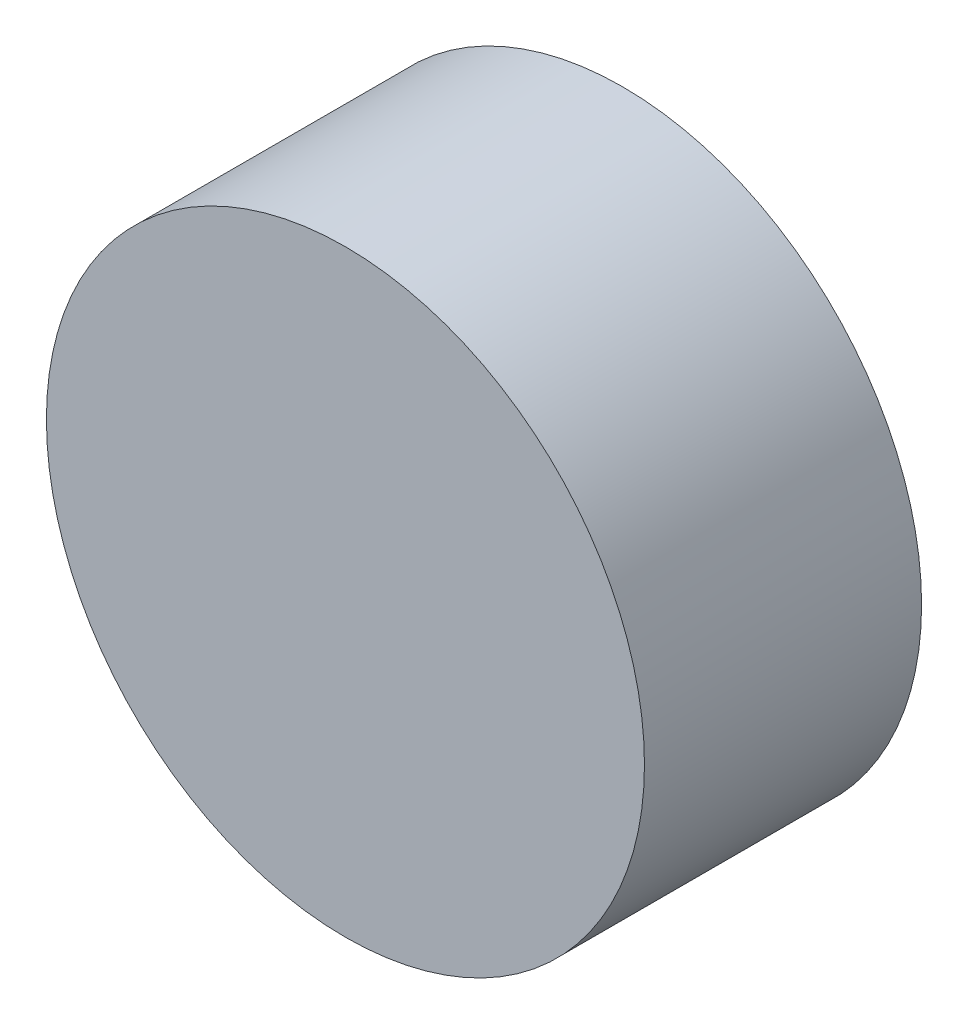
ISO-10303-21;
HEADER;
FILE_DESCRIPTION(('STEP AP214'),'2;1');
FILE_NAME('part.step','',(''),(''),'','','');
FILE_SCHEMA(('AUTOMOTIVE_DESIGN { 1 0 10303 214 1 1 1 1 }'));
ENDSEC;
DATA;
#1=APPLICATION_CONTEXT('core data for automotive mechanical design processes');
#2=APPLICATION_PROTOCOL_DEFINITION('international standard','automotive_design',2000,#1);
#3=PRODUCT_CONTEXT('',#1,'mechanical');
#4=PRODUCT('Part','Part','',(#3));
#5=PRODUCT_RELATED_PRODUCT_CATEGORY('part','',(#4));
#6=PRODUCT_DEFINITION_FORMATION('','',#4);
#7=PRODUCT_DEFINITION_CONTEXT('part definition',#1,'design');
#8=PRODUCT_DEFINITION('design','',#6,#7);
#9=PRODUCT_DEFINITION_SHAPE('','',#8);
#10=(LENGTH_UNIT() NAMED_UNIT(*) SI_UNIT(.MILLI.,.METRE.));
#11=(NAMED_UNIT(*) PLANE_ANGLE_UNIT() SI_UNIT($,.RADIAN.));
#12=(NAMED_UNIT(*) SI_UNIT($,.STERADIAN.) SOLID_ANGLE_UNIT());
#13=UNCERTAINTY_MEASURE_WITH_UNIT(LENGTH_MEASURE(1.E-05),#10,'distance_accuracy_value','');
#14=(GEOMETRIC_REPRESENTATION_CONTEXT(3) GLOBAL_UNCERTAINTY_ASSIGNED_CONTEXT((#13)) GLOBAL_UNIT_ASSIGNED_CONTEXT((#10,
#11,#12)) REPRESENTATION_CONTEXT('',''));
#15=CARTESIAN_POINT('',(0.,0.,0.));
#16=DIRECTION('',(0.,0.,1.));
#17=DIRECTION('',(1.,0.,0.));
#18=AXIS2_PLACEMENT_3D('',#15,#16,#17);
#19=CARTESIAN_POINT('',(28.,15.9999999999979,5.588));
#20=DIRECTION('',(0.,0.,-1.));
#21=DIRECTION('',(-1.,0.,0.));
#22=AXIS2_PLACEMENT_3D('',#19,#20,#21);
#23=PLANE('',#22);
#24=CARTESIAN_POINT('',(16.,16.,5.588));
#25=DIRECTION('',(0.,0.,1.));
#26=DIRECTION('',(1.,0.,0.));
#27=AXIS2_PLACEMENT_3D('',#24,#25,#26);
#28=CIRCLE('',#27,6.0298731);
#29=CARTESIAN_POINT('',(22.0298731,16.,5.588));
#30=VERTEX_POINT('',#29);
#31=EDGE_CURVE('E18',#30,#30,#28,.F.);
#32=ORIENTED_EDGE('',*,*,#31,.F.);
#33=EDGE_LOOP('',(#32));
#34=FACE_BOUND('',#33,.T.);
#35=ADVANCED_FACE('F15',(#34),#23,.F.);
#36=CARTESIAN_POINT('',(28.,15.9999999999979,0.));
#37=DIRECTION('',(0.,0.,-1.));
#38=DIRECTION('',(-1.,0.,0.));
#39=AXIS2_PLACEMENT_3D('',#36,#37,#38);
#40=PLANE('',#39);
#41=CARTESIAN_POINT('',(16.,16.,0.));
#42=DIRECTION('',(0.,0.,1.));
#43=DIRECTION('',(1.,0.,0.));
#44=AXIS2_PLACEMENT_3D('',#41,#42,#43);
#45=CIRCLE('',#44,6.0298731);
#46=CARTESIAN_POINT('',(22.0298731,16.,0.));
#47=VERTEX_POINT('',#46);
#48=EDGE_CURVE('E10',#47,#47,#45,.T.);
#49=ORIENTED_EDGE('',*,*,#48,.F.);
#50=EDGE_LOOP('',(#49));
#51=FACE_BOUND('',#50,.T.);
#52=ADVANCED_FACE('F30',(#51),#40,.T.);
#53=CARTESIAN_POINT('',(16.,16.,5.588));
#54=DIRECTION('',(0.,0.,1.));
#55=DIRECTION('',(1.,0.,0.));
#56=AXIS2_PLACEMENT_3D('',#53,#54,#55);
#57=CYLINDRICAL_SURFACE('',#56,6.0298731);
#58=ORIENTED_EDGE('',*,*,#48,.T.);
#59=EDGE_LOOP('',(#58));
#60=FACE_BOUND('',#59,.T.);
#61=ORIENTED_EDGE('',*,*,#31,.T.);
#62=EDGE_LOOP('',(#61));
#63=FACE_BOUND('',#62,.T.);
#64=ADVANCED_FACE('F27',(#60,#63),#57,.T.);
#65=CLOSED_SHELL('',(#35,#52,#64));
#66=MANIFOLD_SOLID_BREP('B1',#65);
#67=ADVANCED_BREP_SHAPE_REPRESENTATION('',(#18,#66),#14);
#68=SHAPE_DEFINITION_REPRESENTATION(#9,#67);
ENDSEC;
END-ISO-10303-21;
